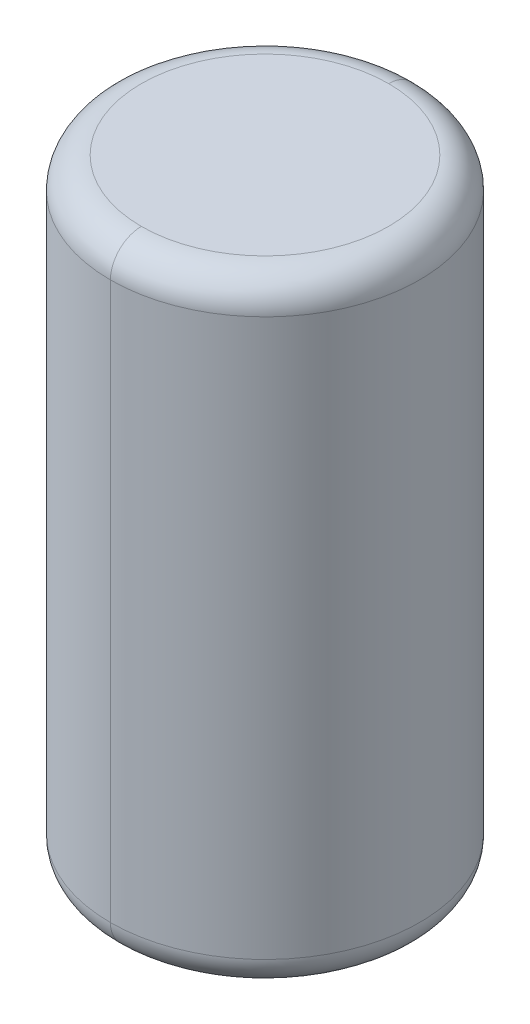
ISO-10303-21;
HEADER;
FILE_DESCRIPTION(('STEP AP214'),'2;1');
FILE_NAME('part.step','',(''),(''),'','','');
FILE_SCHEMA(('AUTOMOTIVE_DESIGN { 1 0 10303 214 1 1 1 1 }'));
ENDSEC;
DATA;
#1=APPLICATION_CONTEXT('core data for automotive mechanical design processes');
#2=APPLICATION_PROTOCOL_DEFINITION('international standard','automotive_design',2000,#1);
#3=PRODUCT_CONTEXT('',#1,'mechanical');
#4=PRODUCT('Part','Part','',(#3));
#5=PRODUCT_RELATED_PRODUCT_CATEGORY('part','',(#4));
#6=PRODUCT_DEFINITION_FORMATION('','',#4);
#7=PRODUCT_DEFINITION_CONTEXT('part definition',#1,'design');
#8=PRODUCT_DEFINITION('design','',#6,#7);
#9=PRODUCT_DEFINITION_SHAPE('','',#8);
#10=(LENGTH_UNIT() NAMED_UNIT(*) SI_UNIT(.MILLI.,.METRE.));
#11=(NAMED_UNIT(*) PLANE_ANGLE_UNIT() SI_UNIT($,.RADIAN.));
#12=(NAMED_UNIT(*) SI_UNIT($,.STERADIAN.) SOLID_ANGLE_UNIT());
#13=UNCERTAINTY_MEASURE_WITH_UNIT(LENGTH_MEASURE(1.E-05),#10,'distance_accuracy_value','');
#14=(GEOMETRIC_REPRESENTATION_CONTEXT(3) GLOBAL_UNCERTAINTY_ASSIGNED_CONTEXT((#13)) GLOBAL_UNIT_ASSIGNED_CONTEXT((#10,
#11,#12)) REPRESENTATION_CONTEXT('',''));
#15=CARTESIAN_POINT('',(0.,0.,0.));
#16=DIRECTION('',(0.,0.,1.));
#17=DIRECTION('',(1.,0.,0.));
#18=AXIS2_PLACEMENT_3D('',#15,#16,#17);
#19=CARTESIAN_POINT('',(0.,12.065,0.));
#20=DIRECTION('',(0.,1.,0.));
#21=DIRECTION('',(0.,0.,1.));
#22=AXIS2_PLACEMENT_3D('',#19,#20,#21);
#23=TOROIDAL_SURFACE('',#22,2.54,0.635);
#24=CARTESIAN_POINT('',(0.,12.065,-2.54));
#25=DIRECTION('',(1.,0.,0.));
#26=DIRECTION('',(0.,0.,-1.));
#27=AXIS2_PLACEMENT_3D('',#24,#25,#26);
#28=CIRCLE('',#27,0.635);
#29=CARTESIAN_POINT('',(0.,12.065,-3.175));
#30=VERTEX_POINT('',#29);
#31=CARTESIAN_POINT('',(0.,12.7,-2.54));
#32=VERTEX_POINT('',#31);
#33=EDGE_CURVE('E76',#30,#32,#28,.T.);
#34=ORIENTED_EDGE('',*,*,#33,.F.);
#35=CARTESIAN_POINT('',(0.,12.065,0.));
#36=DIRECTION('',(0.,-1.,0.));
#37=DIRECTION('',(0.,0.,1.));
#38=AXIS2_PLACEMENT_3D('',#35,#36,#37);
#39=CIRCLE('',#38,3.175);
#40=CARTESIAN_POINT('',(0.,12.065,3.175));
#41=VERTEX_POINT('',#40);
#42=EDGE_CURVE('E64',#41,#30,#39,.T.);
#43=ORIENTED_EDGE('',*,*,#42,.F.);
#44=CARTESIAN_POINT('',(0.,12.065,2.54));
#45=DIRECTION('',(-1.,0.,0.));
#46=DIRECTION('',(0.,0.,1.));
#47=AXIS2_PLACEMENT_3D('',#44,#45,#46);
#48=CIRCLE('',#47,0.635);
#49=CARTESIAN_POINT('',(0.,12.7,2.54));
#50=VERTEX_POINT('',#49);
#51=EDGE_CURVE('E73',#41,#50,#48,.T.);
#52=ORIENTED_EDGE('',*,*,#51,.T.);
#53=CARTESIAN_POINT('',(0.,12.7,0.));
#54=DIRECTION('',(0.,1.,0.));
#55=DIRECTION('',(0.,0.,1.));
#56=AXIS2_PLACEMENT_3D('',#53,#54,#55);
#57=CIRCLE('',#56,2.54);
#58=EDGE_CURVE('E27',#32,#50,#57,.T.);
#59=ORIENTED_EDGE('',*,*,#58,.F.);
#60=EDGE_LOOP('',(#34,#43,#52,#59));
#61=FACE_BOUND('',#60,.T.);
#62=ADVANCED_FACE('F16',(#61),#23,.T.);
#63=CARTESIAN_POINT('',(0.,0.635,0.));
#64=DIRECTION('',(0.,1.,0.));
#65=DIRECTION('',(0.,0.,1.));
#66=AXIS2_PLACEMENT_3D('',#63,#64,#65);
#67=TOROIDAL_SURFACE('',#66,2.54,0.635);
#68=CARTESIAN_POINT('',(0.,0.635,-2.54));
#69=DIRECTION('',(1.,0.,0.));
#70=DIRECTION('',(0.,0.,-1.));
#71=AXIS2_PLACEMENT_3D('',#68,#69,#70);
#72=CIRCLE('',#71,0.635);
#73=CARTESIAN_POINT('',(0.,0.,-2.54));
#74=VERTEX_POINT('',#73);
#75=CARTESIAN_POINT('',(0.,0.635,-3.175));
#76=VERTEX_POINT('',#75);
#77=EDGE_CURVE('E20',#74,#76,#72,.T.);
#78=ORIENTED_EDGE('',*,*,#77,.F.);
#79=CARTESIAN_POINT('',(0.,0.,0.));
#80=DIRECTION('',(0.,-1.,0.));
#81=DIRECTION('',(0.,0.,1.));
#82=AXIS2_PLACEMENT_3D('',#79,#80,#81);
#83=CIRCLE('',#82,2.54);
#84=CARTESIAN_POINT('',(0.,0.,2.54));
#85=VERTEX_POINT('',#84);
#86=EDGE_CURVE('E11',#85,#74,#83,.T.);
#87=ORIENTED_EDGE('',*,*,#86,.F.);
#88=CARTESIAN_POINT('',(0.,0.635,2.54));
#89=DIRECTION('',(-1.,0.,0.));
#90=DIRECTION('',(0.,0.,1.));
#91=AXIS2_PLACEMENT_3D('',#88,#89,#90);
#92=CIRCLE('',#91,0.635);
#93=CARTESIAN_POINT('',(0.,0.635,3.175));
#94=VERTEX_POINT('',#93);
#95=EDGE_CURVE('E88',#85,#94,#92,.T.);
#96=ORIENTED_EDGE('',*,*,#95,.T.);
#97=CARTESIAN_POINT('',(0.,0.635,0.));
#98=DIRECTION('',(0.,1.,0.));
#99=DIRECTION('',(0.,0.,1.));
#100=AXIS2_PLACEMENT_3D('',#97,#98,#99);
#101=CIRCLE('',#100,3.175);
#102=EDGE_CURVE('E42',#76,#94,#101,.T.);
#103=ORIENTED_EDGE('',*,*,#102,.F.);
#104=EDGE_LOOP('',(#78,#87,#96,#103));
#105=FACE_BOUND('',#104,.T.);
#106=ADVANCED_FACE('F139',(#105),#67,.T.);
#107=CARTESIAN_POINT('',(0.,0.,0.));
#108=DIRECTION('',(0.,1.,0.));
#109=DIRECTION('',(1.,0.,0.));
#110=AXIS2_PLACEMENT_3D('',#107,#108,#109);
#111=PLANE('',#110);
#112=ORIENTED_EDGE('',*,*,#86,.T.);
#113=CARTESIAN_POINT('',(0.,0.,0.));
#114=DIRECTION('',(0.,-1.,0.));
#115=DIRECTION('',(0.,0.,1.));
#116=AXIS2_PLACEMENT_3D('',#113,#114,#115);
#117=CIRCLE('',#116,2.54);
#118=EDGE_CURVE('E96',#74,#85,#117,.T.);
#119=ORIENTED_EDGE('',*,*,#118,.T.);
#120=EDGE_LOOP('',(#112,#119));
#121=FACE_BOUND('',#120,.T.);
#122=ADVANCED_FACE('F134',(#121),#111,.F.);
#123=CARTESIAN_POINT('',(0.,12.7,0.));
#124=DIRECTION('',(0.,1.,0.));
#125=DIRECTION('',(1.,0.,0.));
#126=AXIS2_PLACEMENT_3D('',#123,#124,#125);
#127=PLANE('',#126);
#128=CARTESIAN_POINT('',(0.,12.7,0.));
#129=DIRECTION('',(0.,1.,0.));
#130=DIRECTION('',(0.,0.,1.));
#131=AXIS2_PLACEMENT_3D('',#128,#129,#130);
#132=CIRCLE('',#131,2.54);
#133=EDGE_CURVE('E94',#50,#32,#132,.T.);
#134=ORIENTED_EDGE('',*,*,#133,.T.);
#135=ORIENTED_EDGE('',*,*,#58,.T.);
#136=EDGE_LOOP('',(#134,#135));
#137=FACE_BOUND('',#136,.T.);
#138=ADVANCED_FACE('F125',(#137),#127,.T.);
#139=CARTESIAN_POINT('',(0.,12.7,0.));
#140=DIRECTION('',(0.,-1.,0.));
#141=DIRECTION('',(0.,0.,-1.));
#142=AXIS2_PLACEMENT_3D('',#139,#140,#141);
#143=CYLINDRICAL_SURFACE('',#142,3.175);
#144=DIRECTION('',(0.,-1.,0.));
#145=VECTOR('',#144,1.);
#146=CARTESIAN_POINT('',(0.,12.7,3.175));
#147=LINE('',#146,#145);
#148=EDGE_CURVE('E81',#41,#94,#147,.T.);
#149=ORIENTED_EDGE('',*,*,#148,.F.);
#150=ORIENTED_EDGE('',*,*,#42,.T.);
#151=DIRECTION('',(0.,-1.,0.));
#152=VECTOR('',#151,1.);
#153=CARTESIAN_POINT('',(0.,12.7,-3.175));
#154=LINE('',#153,#152);
#155=EDGE_CURVE('E79',#30,#76,#154,.T.);
#156=ORIENTED_EDGE('',*,*,#155,.T.);
#157=ORIENTED_EDGE('',*,*,#102,.T.);
#158=EDGE_LOOP('',(#149,#150,#156,#157));
#159=FACE_BOUND('',#158,.T.);
#160=ADVANCED_FACE('F82',(#159),#143,.T.);
#161=CARTESIAN_POINT('',(0.,12.7,0.));
#162=DIRECTION('',(0.,-1.,0.));
#163=DIRECTION('',(0.,0.,-1.));
#164=AXIS2_PLACEMENT_3D('',#161,#162,#163);
#165=CYLINDRICAL_SURFACE('',#164,3.175);
#166=CARTESIAN_POINT('',(0.,12.065,0.));
#167=DIRECTION('',(0.,-1.,0.));
#168=DIRECTION('',(0.,0.,1.));
#169=AXIS2_PLACEMENT_3D('',#166,#167,#168);
#170=CIRCLE('',#169,3.175);
#171=EDGE_CURVE('E92',#30,#41,#170,.T.);
#172=ORIENTED_EDGE('',*,*,#171,.T.);
#173=ORIENTED_EDGE('',*,*,#148,.T.);
#174=CARTESIAN_POINT('',(0.,0.635,0.));
#175=DIRECTION('',(0.,1.,0.));
#176=DIRECTION('',(0.,0.,1.));
#177=AXIS2_PLACEMENT_3D('',#174,#175,#176);
#178=CIRCLE('',#177,3.175);
#179=EDGE_CURVE('E114',#94,#76,#178,.T.);
#180=ORIENTED_EDGE('',*,*,#179,.T.);
#181=ORIENTED_EDGE('',*,*,#155,.F.);
#182=EDGE_LOOP('',(#172,#173,#180,#181));
#183=FACE_BOUND('',#182,.T.);
#184=ADVANCED_FACE('F98',(#183),#165,.T.);
#185=CARTESIAN_POINT('',(0.,0.635,0.));
#186=DIRECTION('',(0.,1.,0.));
#187=DIRECTION('',(0.,0.,1.));
#188=AXIS2_PLACEMENT_3D('',#185,#186,#187);
#189=TOROIDAL_SURFACE('',#188,2.54,0.635);
#190=ORIENTED_EDGE('',*,*,#118,.F.);
#191=ORIENTED_EDGE('',*,*,#77,.T.);
#192=ORIENTED_EDGE('',*,*,#179,.F.);
#193=ORIENTED_EDGE('',*,*,#95,.F.);
#194=EDGE_LOOP('',(#190,#191,#192,#193));
#195=FACE_BOUND('',#194,.T.);
#196=ADVANCED_FACE('F18',(#195),#189,.T.);
#197=CARTESIAN_POINT('',(0.,12.065,0.));
#198=DIRECTION('',(0.,1.,0.));
#199=DIRECTION('',(0.,0.,1.));
#200=AXIS2_PLACEMENT_3D('',#197,#198,#199);
#201=TOROIDAL_SURFACE('',#200,2.54,0.635);
#202=ORIENTED_EDGE('',*,*,#171,.F.);
#203=ORIENTED_EDGE('',*,*,#33,.T.);
#204=ORIENTED_EDGE('',*,*,#133,.F.);
#205=ORIENTED_EDGE('',*,*,#51,.F.);
#206=EDGE_LOOP('',(#202,#203,#204,#205));
#207=FACE_BOUND('',#206,.T.);
#208=ADVANCED_FACE('F91',(#207),#201,.T.);
#209=CLOSED_SHELL('',(#62,#106,#122,#138,#160,#184,#196,#208));
#210=MANIFOLD_SOLID_BREP('B1',#209);
#211=ADVANCED_BREP_SHAPE_REPRESENTATION('',(#18,#210),#14);
#212=SHAPE_DEFINITION_REPRESENTATION(#9,#211);
ENDSEC;
END-ISO-10303-21;
